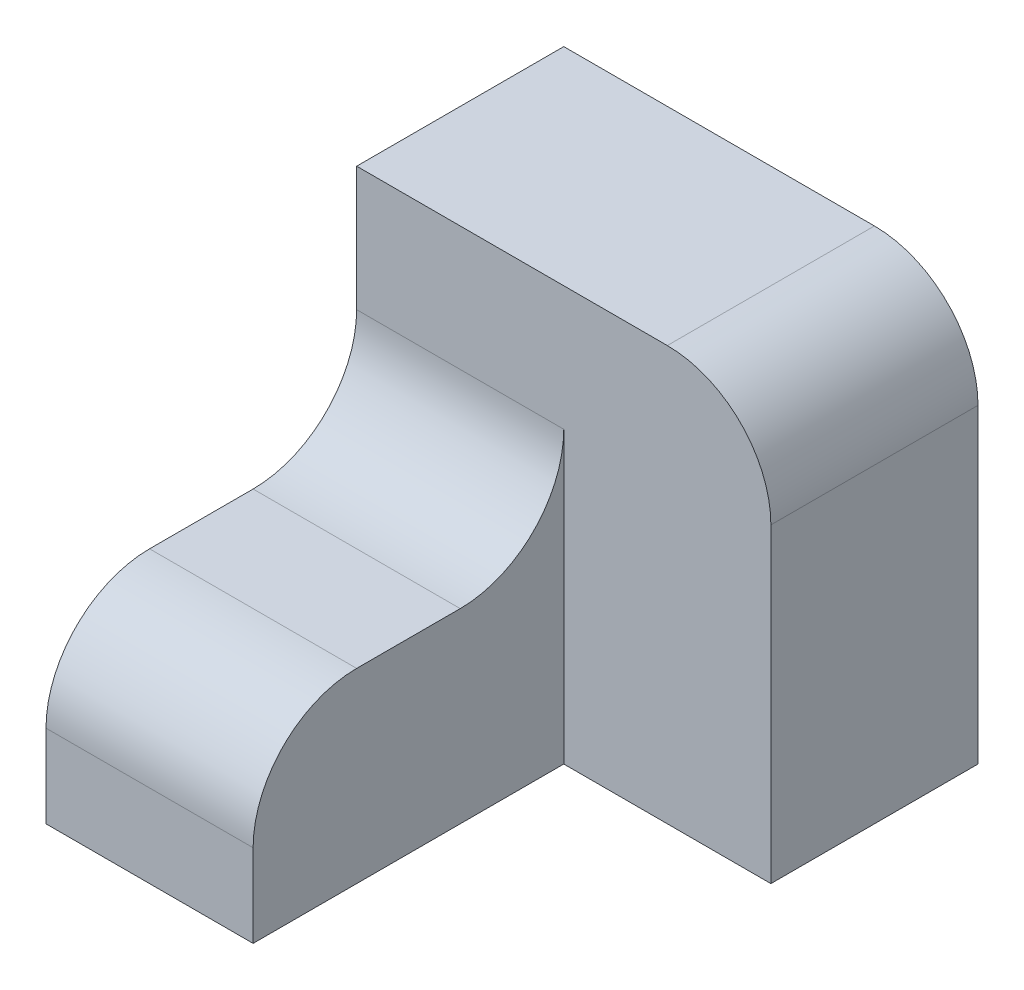
ISO-10303-21;
HEADER;
FILE_DESCRIPTION(('STEP AP214'),'2;1');
FILE_NAME('part.step','',(''),(''),'','','');
FILE_SCHEMA(('AUTOMOTIVE_DESIGN { 1 0 10303 214 1 1 1 1 }'));
ENDSEC;
DATA;
#1=APPLICATION_CONTEXT('core data for automotive mechanical design processes');
#2=APPLICATION_PROTOCOL_DEFINITION('international standard','automotive_design',2000,#1);
#3=PRODUCT_CONTEXT('',#1,'mechanical');
#4=PRODUCT('Part','Part','',(#3));
#5=PRODUCT_RELATED_PRODUCT_CATEGORY('part','',(#4));
#6=PRODUCT_DEFINITION_FORMATION('','',#4);
#7=PRODUCT_DEFINITION_CONTEXT('part definition',#1,'design');
#8=PRODUCT_DEFINITION('design','',#6,#7);
#9=PRODUCT_DEFINITION_SHAPE('','',#8);
#10=(LENGTH_UNIT() NAMED_UNIT(*) SI_UNIT(.MILLI.,.METRE.));
#11=(NAMED_UNIT(*) PLANE_ANGLE_UNIT() SI_UNIT($,.RADIAN.));
#12=(NAMED_UNIT(*) SI_UNIT($,.STERADIAN.) SOLID_ANGLE_UNIT());
#13=UNCERTAINTY_MEASURE_WITH_UNIT(LENGTH_MEASURE(1.E-05),#10,'distance_accuracy_value','');
#14=(GEOMETRIC_REPRESENTATION_CONTEXT(3) GLOBAL_UNCERTAINTY_ASSIGNED_CONTEXT((#13)) GLOBAL_UNIT_ASSIGNED_CONTEXT((#10,
#11,#12)) REPRESENTATION_CONTEXT('',''));
#15=CARTESIAN_POINT('',(0.,0.,0.));
#16=DIRECTION('',(0.,0.,1.));
#17=DIRECTION('',(1.,0.,0.));
#18=AXIS2_PLACEMENT_3D('',#15,#16,#17);
#19=CARTESIAN_POINT('',(-10.,0.,30.));
#20=DIRECTION('',(0.,-1.,0.));
#21=DIRECTION('',(1.,0.,0.));
#22=AXIS2_PLACEMENT_3D('',#19,#20,#21);
#23=PLANE('',#22);
#24=DIRECTION('',(0.,0.,-1.));
#25=VECTOR('',#24,1.);
#26=CARTESIAN_POINT('',(-10.,0.,30.));
#27=LINE('',#26,#25);
#28=CARTESIAN_POINT('',(-10.,0.,20.));
#29=VERTEX_POINT('',#28);
#30=CARTESIAN_POINT('',(-10.,0.,10.));
#31=VERTEX_POINT('',#30);
#32=EDGE_CURVE('E164',#29,#31,#27,.T.);
#33=ORIENTED_EDGE('',*,*,#32,.T.);
#34=DIRECTION('',(-1.,0.,0.));
#35=VECTOR('',#34,1.);
#36=CARTESIAN_POINT('',(-10.,0.,10.));
#37=LINE('',#36,#35);
#38=CARTESIAN_POINT('',(-30.,0.,10.));
#39=VERTEX_POINT('',#38);
#40=EDGE_CURVE('E178',#31,#39,#37,.T.);
#41=ORIENTED_EDGE('',*,*,#40,.T.);
#42=DIRECTION('',(0.,0.,-1.));
#43=VECTOR('',#42,1.);
#44=CARTESIAN_POINT('',(-30.,0.,30.));
#45=LINE('',#44,#43);
#46=CARTESIAN_POINT('',(-30.,0.,20.));
#47=VERTEX_POINT('',#46);
#48=EDGE_CURVE('E173',#47,#39,#45,.T.);
#49=ORIENTED_EDGE('',*,*,#48,.F.);
#50=DIRECTION('',(-1.,0.,0.));
#51=VECTOR('',#50,1.);
#52=CARTESIAN_POINT('',(-10.,0.,20.));
#53=LINE('',#52,#51);
#54=EDGE_CURVE('E176',#47,#29,#53,.F.);
#55=ORIENTED_EDGE('',*,*,#54,.T.);
#56=EDGE_LOOP('',(#33,#41,#49,#55));
#57=FACE_BOUND('',#56,.T.);
#58=ADVANCED_FACE('F35',(#57),#23,.F.);
#59=CARTESIAN_POINT('',(-30.,0.,30.));
#60=DIRECTION('',(1.,0.,0.));
#61=DIRECTION('',(0.,0.,-1.));
#62=AXIS2_PLACEMENT_3D('',#59,#60,#61);
#63=PLANE('',#62);
#64=DIRECTION('',(0.,-1.,0.));
#65=VECTOR('',#64,1.);
#66=CARTESIAN_POINT('',(-30.,0.,30.));
#67=LINE('',#66,#65);
#68=CARTESIAN_POINT('',(-30.,-10.,30.));
#69=VERTEX_POINT('',#68);
#70=CARTESIAN_POINT('',(-30.,-18.,30.));
#71=VERTEX_POINT('',#70);
#72=EDGE_CURVE('E158',#69,#71,#67,.T.);
#73=ORIENTED_EDGE('',*,*,#72,.F.);
#74=CARTESIAN_POINT('',(-30.,-10.,20.));
#75=DIRECTION('',(1.,0.,0.));
#76=DIRECTION('',(0.,0.,-1.));
#77=AXIS2_PLACEMENT_3D('',#74,#75,#76);
#78=CIRCLE('',#77,10.);
#79=EDGE_CURVE('E58',#69,#47,#78,.F.);
#80=ORIENTED_EDGE('',*,*,#79,.T.);
#81=ORIENTED_EDGE('',*,*,#48,.T.);
#82=CARTESIAN_POINT('',(-30.,10.,10.));
#83=DIRECTION('',(1.,0.,0.));
#84=DIRECTION('',(0.,0.,-1.));
#85=AXIS2_PLACEMENT_3D('',#82,#83,#84);
#86=CIRCLE('',#85,10.);
#87=CARTESIAN_POINT('',(-30.,10.,0.));
#88=VERTEX_POINT('',#87);
#89=EDGE_CURVE('E43',#39,#88,#86,.T.);
#90=ORIENTED_EDGE('',*,*,#89,.T.);
#91=DIRECTION('',(0.,-1.,0.));
#92=VECTOR('',#91,1.);
#93=CARTESIAN_POINT('',(-30.,22.,0.));
#94=LINE('',#93,#92);
#95=CARTESIAN_POINT('',(-30.,22.,0.));
#96=VERTEX_POINT('',#95);
#97=EDGE_CURVE('E134',#96,#88,#94,.T.);
#98=ORIENTED_EDGE('',*,*,#97,.F.);
#99=DIRECTION('',(0.,0.,1.));
#100=VECTOR('',#99,1.);
#101=CARTESIAN_POINT('',(-30.,22.,-20.));
#102=LINE('',#101,#100);
#103=CARTESIAN_POINT('',(-30.,22.,-20.));
#104=VERTEX_POINT('',#103);
#105=EDGE_CURVE('E118',#104,#96,#102,.T.);
#106=ORIENTED_EDGE('',*,*,#105,.F.);
#107=DIRECTION('',(0.,-1.,0.));
#108=VECTOR('',#107,1.);
#109=CARTESIAN_POINT('',(-30.,22.,-20.));
#110=LINE('',#109,#108);
#111=CARTESIAN_POINT('',(-30.,-18.,-20.));
#112=VERTEX_POINT('',#111);
#113=EDGE_CURVE('E125',#104,#112,#110,.T.);
#114=ORIENTED_EDGE('',*,*,#113,.T.);
#115=DIRECTION('',(0.,0.,-1.));
#116=VECTOR('',#115,1.);
#117=CARTESIAN_POINT('',(-30.,-18.,30.));
#118=LINE('',#117,#116);
#119=EDGE_CURVE('E171',#71,#112,#118,.T.);
#120=ORIENTED_EDGE('',*,*,#119,.F.);
#121=EDGE_LOOP('',(#73,#80,#81,#90,#98,#106,#114,#120));
#122=FACE_BOUND('',#121,.T.);
#123=ADVANCED_FACE('F131',(#122),#63,.F.);
#124=CARTESIAN_POINT('',(-30.,-18.,30.));
#125=DIRECTION('',(0.,1.,0.));
#126=DIRECTION('',(0.,0.,1.));
#127=AXIS2_PLACEMENT_3D('',#124,#125,#126);
#128=PLANE('',#127);
#129=ORIENTED_EDGE('',*,*,#119,.T.);
#130=DIRECTION('',(1.,0.,0.));
#131=VECTOR('',#130,1.);
#132=CARTESIAN_POINT('',(-30.,-18.,-20.));
#133=LINE('',#132,#131);
#134=CARTESIAN_POINT('',(10.,-18.,-20.));
#135=VERTEX_POINT('',#134);
#136=EDGE_CURVE('E142',#112,#135,#133,.T.);
#137=ORIENTED_EDGE('',*,*,#136,.T.);
#138=DIRECTION('',(0.,0.,1.));
#139=VECTOR('',#138,1.);
#140=CARTESIAN_POINT('',(10.,-18.,-20.));
#141=LINE('',#140,#139);
#142=CARTESIAN_POINT('',(10.,-18.,0.));
#143=VERTEX_POINT('',#142);
#144=EDGE_CURVE('E135',#135,#143,#141,.T.);
#145=ORIENTED_EDGE('',*,*,#144,.T.);
#146=DIRECTION('',(1.,0.,0.));
#147=VECTOR('',#146,1.);
#148=CARTESIAN_POINT('',(-30.,-18.,0.));
#149=LINE('',#148,#147);
#150=CARTESIAN_POINT('',(-10.,-18.,0.));
#151=VERTEX_POINT('',#150);
#152=EDGE_CURVE('E151',#151,#143,#149,.T.);
#153=ORIENTED_EDGE('',*,*,#152,.F.);
#154=DIRECTION('',(0.,0.,-1.));
#155=VECTOR('',#154,1.);
#156=CARTESIAN_POINT('',(-10.,-18.,30.));
#157=LINE('',#156,#155);
#158=CARTESIAN_POINT('',(-10.,-18.,30.));
#159=VERTEX_POINT('',#158);
#160=EDGE_CURVE('E168',#159,#151,#157,.T.);
#161=ORIENTED_EDGE('',*,*,#160,.F.);
#162=DIRECTION('',(1.,0.,0.));
#163=VECTOR('',#162,1.);
#164=CARTESIAN_POINT('',(-30.,-18.,30.));
#165=LINE('',#164,#163);
#166=EDGE_CURVE('E160',#71,#159,#165,.T.);
#167=ORIENTED_EDGE('',*,*,#166,.F.);
#168=EDGE_LOOP('',(#129,#137,#145,#153,#161,#167));
#169=FACE_BOUND('',#168,.T.);
#170=ADVANCED_FACE('F210',(#169),#128,.F.);
#171=CARTESIAN_POINT('',(-10.,-18.,30.));
#172=DIRECTION('',(-1.,0.,0.));
#173=DIRECTION('',(0.,0.,1.));
#174=AXIS2_PLACEMENT_3D('',#171,#172,#173);
#175=PLANE('',#174);
#176=ORIENTED_EDGE('',*,*,#32,.F.);
#177=CARTESIAN_POINT('',(-10.,-10.,20.));
#178=DIRECTION('',(-1.,0.,0.));
#179=DIRECTION('',(0.,0.,1.));
#180=AXIS2_PLACEMENT_3D('',#177,#178,#179);
#181=CIRCLE('',#180,10.);
#182=CARTESIAN_POINT('',(-10.,-10.,30.));
#183=VERTEX_POINT('',#182);
#184=EDGE_CURVE('E50',#29,#183,#181,.F.);
#185=ORIENTED_EDGE('',*,*,#184,.T.);
#186=DIRECTION('',(0.,1.,0.));
#187=VECTOR('',#186,1.);
#188=CARTESIAN_POINT('',(-10.,-18.,30.));
#189=LINE('',#188,#187);
#190=EDGE_CURVE('E162',#159,#183,#189,.T.);
#191=ORIENTED_EDGE('',*,*,#190,.F.);
#192=ORIENTED_EDGE('',*,*,#160,.T.);
#193=DIRECTION('',(0.,1.,0.));
#194=VECTOR('',#193,1.);
#195=CARTESIAN_POINT('',(-10.,-18.,0.));
#196=LINE('',#195,#194);
#197=CARTESIAN_POINT('',(-10.,10.,0.));
#198=VERTEX_POINT('',#197);
#199=EDGE_CURVE('E156',#151,#198,#196,.T.);
#200=ORIENTED_EDGE('',*,*,#199,.T.);
#201=CARTESIAN_POINT('',(-10.,10.,10.));
#202=DIRECTION('',(-1.,0.,0.));
#203=DIRECTION('',(0.,0.,1.));
#204=AXIS2_PLACEMENT_3D('',#201,#202,#203);
#205=CIRCLE('',#204,10.);
#206=EDGE_CURVE('E11',#198,#31,#205,.T.);
#207=ORIENTED_EDGE('',*,*,#206,.T.);
#208=EDGE_LOOP('',(#176,#185,#191,#192,#200,#207));
#209=FACE_BOUND('',#208,.T.);
#210=ADVANCED_FACE('F203',(#209),#175,.F.);
#211=CARTESIAN_POINT('',(0.,0.,30.));
#212=DIRECTION('',(0.,0.,1.));
#213=DIRECTION('',(1.,0.,0.));
#214=AXIS2_PLACEMENT_3D('',#211,#212,#213);
#215=PLANE('',#214);
#216=ORIENTED_EDGE('',*,*,#190,.T.);
#217=DIRECTION('',(-1.,0.,0.));
#218=VECTOR('',#217,1.);
#219=CARTESIAN_POINT('',(-30.,-10.,30.));
#220=LINE('',#219,#218);
#221=EDGE_CURVE('E192',#183,#69,#220,.T.);
#222=ORIENTED_EDGE('',*,*,#221,.T.);
#223=ORIENTED_EDGE('',*,*,#72,.T.);
#224=ORIENTED_EDGE('',*,*,#166,.T.);
#225=EDGE_LOOP('',(#216,#222,#223,#224));
#226=FACE_BOUND('',#225,.T.);
#227=ADVANCED_FACE('F206',(#226),#215,.T.);
#228=CARTESIAN_POINT('',(0.,0.,0.));
#229=DIRECTION('',(0.,0.,1.));
#230=DIRECTION('',(1.,0.,0.));
#231=AXIS2_PLACEMENT_3D('',#228,#229,#230);
#232=PLANE('',#231);
#233=ORIENTED_EDGE('',*,*,#97,.T.);
#234=DIRECTION('',(-1.,0.,0.));
#235=VECTOR('',#234,1.);
#236=CARTESIAN_POINT('',(0.,10.,0.));
#237=LINE('',#236,#235);
#238=EDGE_CURVE('E183',#88,#198,#237,.F.);
#239=ORIENTED_EDGE('',*,*,#238,.T.);
#240=ORIENTED_EDGE('',*,*,#199,.F.);
#241=ORIENTED_EDGE('',*,*,#152,.T.);
#242=DIRECTION('',(0.,1.,0.));
#243=VECTOR('',#242,1.);
#244=CARTESIAN_POINT('',(10.,-18.,0.));
#245=LINE('',#244,#243);
#246=CARTESIAN_POINT('',(10.,12.,0.));
#247=VERTEX_POINT('',#246);
#248=EDGE_CURVE('E126',#143,#247,#245,.T.);
#249=ORIENTED_EDGE('',*,*,#248,.T.);
#250=CARTESIAN_POINT('',(0.,12.,0.));
#251=DIRECTION('',(0.,0.,1.));
#252=DIRECTION('',(1.,0.,0.));
#253=AXIS2_PLACEMENT_3D('',#250,#251,#252);
#254=CIRCLE('',#253,10.);
#255=CARTESIAN_POINT('',(0.,22.,0.));
#256=VERTEX_POINT('',#255);
#257=EDGE_CURVE('E181',#247,#256,#254,.T.);
#258=ORIENTED_EDGE('',*,*,#257,.T.);
#259=DIRECTION('',(-1.,0.,0.));
#260=VECTOR('',#259,1.);
#261=CARTESIAN_POINT('',(10.,22.,0.));
#262=LINE('',#261,#260);
#263=EDGE_CURVE('E148',#256,#96,#262,.T.);
#264=ORIENTED_EDGE('',*,*,#263,.T.);
#265=EDGE_LOOP('',(#233,#239,#240,#241,#249,#258,#264));
#266=FACE_BOUND('',#265,.T.);
#267=ADVANCED_FACE('F200',(#266),#232,.T.);
#268=CARTESIAN_POINT('',(10.,22.,-20.));
#269=DIRECTION('',(0.,1.,0.));
#270=DIRECTION('',(-1.,0.,0.));
#271=AXIS2_PLACEMENT_3D('',#268,#269,#270);
#272=PLANE('',#271);
#273=ORIENTED_EDGE('',*,*,#263,.F.);
#274=DIRECTION('',(0.,0.,1.));
#275=VECTOR('',#274,1.);
#276=CARTESIAN_POINT('',(0.,22.,-20.));
#277=LINE('',#276,#275);
#278=CARTESIAN_POINT('',(0.,22.,-20.));
#279=VERTEX_POINT('',#278);
#280=EDGE_CURVE('E121',#256,#279,#277,.F.);
#281=ORIENTED_EDGE('',*,*,#280,.T.);
#282=DIRECTION('',(-1.,0.,0.));
#283=VECTOR('',#282,1.);
#284=CARTESIAN_POINT('',(10.,22.,-20.));
#285=LINE('',#284,#283);
#286=EDGE_CURVE('E114',#279,#104,#285,.T.);
#287=ORIENTED_EDGE('',*,*,#286,.T.);
#288=ORIENTED_EDGE('',*,*,#105,.T.);
#289=EDGE_LOOP('',(#273,#281,#287,#288));
#290=FACE_BOUND('',#289,.T.);
#291=ADVANCED_FACE('F117',(#290),#272,.T.);
#292=CARTESIAN_POINT('',(10.,-18.,-20.));
#293=DIRECTION('',(1.,0.,0.));
#294=DIRECTION('',(0.,0.,-1.));
#295=AXIS2_PLACEMENT_3D('',#292,#293,#294);
#296=PLANE('',#295);
#297=DIRECTION('',(0.,1.,0.));
#298=VECTOR('',#297,1.);
#299=CARTESIAN_POINT('',(10.,-18.,-20.));
#300=LINE('',#299,#298);
#301=CARTESIAN_POINT('',(10.,12.,-20.));
#302=VERTEX_POINT('',#301);
#303=EDGE_CURVE('E136',#135,#302,#300,.T.);
#304=ORIENTED_EDGE('',*,*,#303,.T.);
#305=DIRECTION('',(0.,0.,1.));
#306=VECTOR('',#305,1.);
#307=CARTESIAN_POINT('',(10.,12.,-20.));
#308=LINE('',#307,#306);
#309=EDGE_CURVE('E186',#302,#247,#308,.T.);
#310=ORIENTED_EDGE('',*,*,#309,.T.);
#311=ORIENTED_EDGE('',*,*,#248,.F.);
#312=ORIENTED_EDGE('',*,*,#144,.F.);
#313=EDGE_LOOP('',(#304,#310,#311,#312));
#314=FACE_BOUND('',#313,.T.);
#315=ADVANCED_FACE('F214',(#314),#296,.T.);
#316=CARTESIAN_POINT('',(0.,0.,-20.));
#317=DIRECTION('',(0.,0.,1.));
#318=DIRECTION('',(1.,0.,0.));
#319=AXIS2_PLACEMENT_3D('',#316,#317,#318);
#320=PLANE('',#319);
#321=ORIENTED_EDGE('',*,*,#286,.F.);
#322=CARTESIAN_POINT('',(0.,12.,-20.));
#323=DIRECTION('',(0.,0.,1.));
#324=DIRECTION('',(1.,0.,0.));
#325=AXIS2_PLACEMENT_3D('',#322,#323,#324);
#326=CIRCLE('',#325,10.);
#327=EDGE_CURVE('E190',#279,#302,#326,.F.);
#328=ORIENTED_EDGE('',*,*,#327,.T.);
#329=ORIENTED_EDGE('',*,*,#303,.F.);
#330=ORIENTED_EDGE('',*,*,#136,.F.);
#331=ORIENTED_EDGE('',*,*,#113,.F.);
#332=EDGE_LOOP('',(#321,#328,#329,#330,#331));
#333=FACE_BOUND('',#332,.T.);
#334=ADVANCED_FACE('F139',(#333),#320,.F.);
#335=CARTESIAN_POINT('',(-10.,10.,10.));
#336=DIRECTION('',(-1.,0.,0.));
#337=DIRECTION('',(0.,-1.,0.));
#338=AXIS2_PLACEMENT_3D('',#335,#336,#337);
#339=CYLINDRICAL_SURFACE('',#338,10.);
#340=ORIENTED_EDGE('',*,*,#206,.F.);
#341=ORIENTED_EDGE('',*,*,#238,.F.);
#342=ORIENTED_EDGE('',*,*,#89,.F.);
#343=ORIENTED_EDGE('',*,*,#40,.F.);
#344=EDGE_LOOP('',(#340,#341,#342,#343));
#345=FACE_BOUND('',#344,.T.);
#346=ADVANCED_FACE('F202',(#345),#339,.F.);
#347=CARTESIAN_POINT('',(0.,12.,-20.));
#348=DIRECTION('',(0.,0.,1.));
#349=DIRECTION('',(1.,0.,0.));
#350=AXIS2_PLACEMENT_3D('',#347,#348,#349);
#351=CYLINDRICAL_SURFACE('',#350,10.);
#352=ORIENTED_EDGE('',*,*,#327,.F.);
#353=ORIENTED_EDGE('',*,*,#280,.F.);
#354=ORIENTED_EDGE('',*,*,#257,.F.);
#355=ORIENTED_EDGE('',*,*,#309,.F.);
#356=EDGE_LOOP('',(#352,#353,#354,#355));
#357=FACE_BOUND('',#356,.T.);
#358=ADVANCED_FACE('F217',(#357),#351,.T.);
#359=CARTESIAN_POINT('',(0.,-10.,20.));
#360=DIRECTION('',(1.,0.,0.));
#361=DIRECTION('',(0.,1.,0.));
#362=AXIS2_PLACEMENT_3D('',#359,#360,#361);
#363=CYLINDRICAL_SURFACE('',#362,10.);
#364=ORIENTED_EDGE('',*,*,#184,.F.);
#365=ORIENTED_EDGE('',*,*,#54,.F.);
#366=ORIENTED_EDGE('',*,*,#79,.F.);
#367=ORIENTED_EDGE('',*,*,#221,.F.);
#368=EDGE_LOOP('',(#364,#365,#366,#367));
#369=FACE_BOUND('',#368,.T.);
#370=ADVANCED_FACE('F37',(#369),#363,.T.);
#371=CLOSED_SHELL('',(#58,#123,#170,#210,#227,#267,#291,#315,#334,#346,#358,#370));
#372=MANIFOLD_SOLID_BREP('B2',#371);
#373=ADVANCED_BREP_SHAPE_REPRESENTATION('',(#18,#372),#14);
#374=SHAPE_DEFINITION_REPRESENTATION(#9,#373);
ENDSEC;
END-ISO-10303-21;
